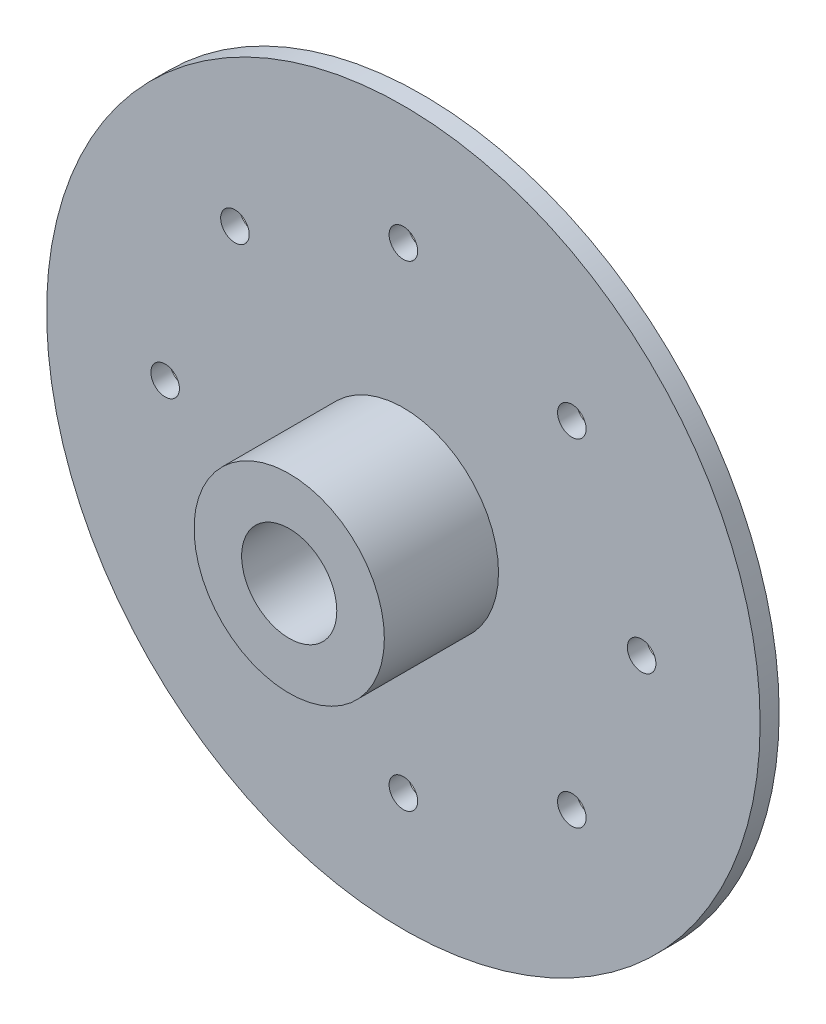
ISO-10303-21;
HEADER;
FILE_DESCRIPTION(('STEP AP214'),'2;1');
FILE_NAME('part.step','',(''),(''),'','','');
FILE_SCHEMA(('AUTOMOTIVE_DESIGN { 1 0 10303 214 1 1 1 1 }'));
ENDSEC;
DATA;
#1=APPLICATION_CONTEXT('core data for automotive mechanical design processes');
#2=APPLICATION_PROTOCOL_DEFINITION('international standard','automotive_design',2000,#1);
#3=PRODUCT_CONTEXT('',#1,'mechanical');
#4=PRODUCT('Part','Part','',(#3));
#5=PRODUCT_RELATED_PRODUCT_CATEGORY('part','',(#4));
#6=PRODUCT_DEFINITION_FORMATION('','',#4);
#7=PRODUCT_DEFINITION_CONTEXT('part definition',#1,'design');
#8=PRODUCT_DEFINITION('design','',#6,#7);
#9=PRODUCT_DEFINITION_SHAPE('','',#8);
#10=(LENGTH_UNIT() NAMED_UNIT(*) SI_UNIT(.MILLI.,.METRE.));
#11=(NAMED_UNIT(*) PLANE_ANGLE_UNIT() SI_UNIT($,.RADIAN.));
#12=(NAMED_UNIT(*) SI_UNIT($,.STERADIAN.) SOLID_ANGLE_UNIT());
#13=UNCERTAINTY_MEASURE_WITH_UNIT(LENGTH_MEASURE(1.E-05),#10,'distance_accuracy_value','');
#14=(GEOMETRIC_REPRESENTATION_CONTEXT(3) GLOBAL_UNCERTAINTY_ASSIGNED_CONTEXT((#13)) GLOBAL_UNIT_ASSIGNED_CONTEXT((#10,
#11,#12)) REPRESENTATION_CONTEXT('',''));
#15=CARTESIAN_POINT('',(0.,0.,0.));
#16=DIRECTION('',(0.,0.,1.));
#17=DIRECTION('',(1.,0.,0.));
#18=AXIS2_PLACEMENT_3D('',#15,#16,#17);
#19=CARTESIAN_POINT('',(0.,0.,2.));
#20=DIRECTION('',(0.,0.,-1.));
#21=DIRECTION('',(-1.,0.,0.));
#22=AXIS2_PLACEMENT_3D('',#19,#20,#21);
#23=CYLINDRICAL_SURFACE('',#22,37.5);
#24=CARTESIAN_POINT('',(0.,0.,2.));
#25=DIRECTION('',(0.,0.,1.));
#26=DIRECTION('',(1.,0.,0.));
#27=AXIS2_PLACEMENT_3D('',#24,#25,#26);
#28=CIRCLE('',#27,37.5);
#29=CARTESIAN_POINT('',(37.5,0.,2.));
#30=VERTEX_POINT('',#29);
#31=EDGE_CURVE('E36',#30,#30,#28,.T.);
#32=ORIENTED_EDGE('',*,*,#31,.F.);
#33=EDGE_LOOP('',(#32));
#34=FACE_BOUND('',#33,.T.);
#35=CARTESIAN_POINT('',(0.,0.,0.));
#36=DIRECTION('',(0.,0.,1.));
#37=DIRECTION('',(1.,0.,0.));
#38=AXIS2_PLACEMENT_3D('',#35,#36,#37);
#39=CIRCLE('',#38,37.5);
#40=CARTESIAN_POINT('',(37.5,0.,0.));
#41=VERTEX_POINT('',#40);
#42=EDGE_CURVE('E40',#41,#41,#39,.T.);
#43=ORIENTED_EDGE('',*,*,#42,.T.);
#44=EDGE_LOOP('',(#43));
#45=FACE_BOUND('',#44,.T.);
#46=ADVANCED_FACE('F30',(#34,#45),#23,.T.);
#47=CARTESIAN_POINT('',(0.,0.,2.));
#48=DIRECTION('',(0.,0.,1.));
#49=DIRECTION('',(1.,0.,0.));
#50=AXIS2_PLACEMENT_3D('',#47,#48,#49);
#51=PLANE('',#50);
#52=CARTESIAN_POINT('',(0.,0.,2.));
#53=DIRECTION('',(0.,0.,1.));
#54=DIRECTION('',(1.,0.,0.));
#55=AXIS2_PLACEMENT_3D('',#52,#53,#54);
#56=CIRCLE('',#55,10.);
#57=CARTESIAN_POINT('',(10.,0.,2.));
#58=VERTEX_POINT('',#57);
#59=EDGE_CURVE('E258',#58,#58,#56,.T.);
#60=ORIENTED_EDGE('',*,*,#59,.F.);
#61=EDGE_LOOP('',(#60));
#62=FACE_BOUND('',#61,.T.);
#63=CARTESIAN_POINT('',(-25.0400641025641,-0.040064102564196,2.));
#64=DIRECTION('',(0.,0.,1.));
#65=DIRECTION('',(0.,1.,0.));
#66=AXIS2_PLACEMENT_3D('',#63,#64,#65);
#67=CIRCLE('',#66,1.5);
#68=CARTESIAN_POINT('',(-25.0400641025641,1.4599358974358,2.));
#69=VERTEX_POINT('',#68);
#70=EDGE_CURVE('E238',#69,#69,#67,.T.);
#71=ORIENTED_EDGE('',*,*,#70,.F.);
#72=EDGE_LOOP('',(#71));
#73=FACE_BOUND('',#72,.T.);
#74=CARTESIAN_POINT('',(-17.7059991282688,-17.7460632308331,2.));
#75=DIRECTION('',(0.,0.,1.));
#76=DIRECTION('',(-0.707106781186551,0.707106781186544,0.));
#77=AXIS2_PLACEMENT_3D('',#74,#75,#76);
#78=CIRCLE('',#77,1.5);
#79=CARTESIAN_POINT('',(-18.7666593000486,-16.6854030590533,2.));
#80=VERTEX_POINT('',#79);
#81=EDGE_CURVE('E240',#80,#80,#78,.T.);
#82=ORIENTED_EDGE('',*,*,#81,.F.);
#83=EDGE_LOOP('',(#82));
#84=FACE_BOUND('',#83,.T.);
#85=CARTESIAN_POINT('',(0.,-25.0801282051282,2.));
#86=DIRECTION('',(0.,0.,1.));
#87=DIRECTION('',(-1.,0.,0.));
#88=AXIS2_PLACEMENT_3D('',#85,#86,#87);
#89=CIRCLE('',#88,1.5);
#90=CARTESIAN_POINT('',(-1.49999999999999,-25.0801282051282,2.));
#91=VERTEX_POINT('',#90);
#92=EDGE_CURVE('E246',#91,#91,#89,.T.);
#93=ORIENTED_EDGE('',*,*,#92,.F.);
#94=EDGE_LOOP('',(#93));
#95=FACE_BOUND('',#94,.T.);
#96=CARTESIAN_POINT('',(17.7059991282691,-17.7460632308329,2.));
#97=DIRECTION('',(0.,0.,1.));
#98=DIRECTION('',(-0.707106781186541,-0.707106781186554,0.));
#99=AXIS2_PLACEMENT_3D('',#96,#97,#98);
#100=CIRCLE('',#99,1.5);
#101=CARTESIAN_POINT('',(16.6453389564893,-18.8067234026127,2.));
#102=VERTEX_POINT('',#101);
#103=EDGE_CURVE('E243',#102,#102,#100,.T.);
#104=ORIENTED_EDGE('',*,*,#103,.F.);
#105=EDGE_LOOP('',(#104));
#106=FACE_BOUND('',#105,.T.);
#107=CARTESIAN_POINT('',(25.0400641025641,-0.0400641025638342,2.));
#108=DIRECTION('',(0.,0.,1.));
#109=DIRECTION('',(0.,-1.,0.));
#110=AXIS2_PLACEMENT_3D('',#107,#108,#109);
#111=CIRCLE('',#110,1.5);
#112=CARTESIAN_POINT('',(25.0400641025641,-1.54006410256384,2.));
#113=VERTEX_POINT('',#112);
#114=EDGE_CURVE('E247',#113,#113,#111,.T.);
#115=ORIENTED_EDGE('',*,*,#114,.F.);
#116=EDGE_LOOP('',(#115));
#117=FACE_BOUND('',#116,.T.);
#118=CARTESIAN_POINT('',(17.7059991282687,17.665935025705,2.));
#119=DIRECTION('',(0.,0.,1.));
#120=DIRECTION('',(0.707106781186556,-0.707106781186539,0.));
#121=AXIS2_PLACEMENT_3D('',#118,#119,#120);
#122=CIRCLE('',#121,1.5);
#123=CARTESIAN_POINT('',(18.7666593000485,16.6052748539252,2.));
#124=VERTEX_POINT('',#123);
#125=EDGE_CURVE('E252',#124,#124,#122,.T.);
#126=ORIENTED_EDGE('',*,*,#125,.F.);
#127=EDGE_LOOP('',(#126));
#128=FACE_BOUND('',#127,.T.);
#129=CARTESIAN_POINT('',(-17.7059991282689,17.6659350257048,2.));
#130=DIRECTION('',(0.,0.,1.));
#131=DIRECTION('',(0.707106781186546,0.707106781186549,0.));
#132=AXIS2_PLACEMENT_3D('',#129,#130,#131);
#133=CIRCLE('',#132,1.5);
#134=CARTESIAN_POINT('',(-16.6453389564891,18.7265951974846,2.));
#135=VERTEX_POINT('',#134);
#136=EDGE_CURVE('E57',#135,#135,#133,.T.);
#137=ORIENTED_EDGE('',*,*,#136,.F.);
#138=EDGE_LOOP('',(#137));
#139=FACE_BOUND('',#138,.T.);
#140=CARTESIAN_POINT('',(0.,25.,2.));
#141=DIRECTION('',(0.,0.,1.));
#142=DIRECTION('',(1.,0.,0.));
#143=AXIS2_PLACEMENT_3D('',#140,#141,#142);
#144=CIRCLE('',#143,1.5);
#145=CARTESIAN_POINT('',(1.5,25.,2.));
#146=VERTEX_POINT('',#145);
#147=EDGE_CURVE('E48',#146,#146,#144,.T.);
#148=ORIENTED_EDGE('',*,*,#147,.F.);
#149=EDGE_LOOP('',(#148));
#150=FACE_BOUND('',#149,.T.);
#151=ORIENTED_EDGE('',*,*,#31,.T.);
#152=EDGE_LOOP('',(#151));
#153=FACE_BOUND('',#152,.T.);
#154=ADVANCED_FACE('F81',(#62,#73,#84,#95,#106,#117,#128,#139,#150,#153),#51,.T.);
#155=CARTESIAN_POINT('',(0.,0.,0.));
#156=DIRECTION('',(0.,0.,1.));
#157=DIRECTION('',(1.,0.,0.));
#158=AXIS2_PLACEMENT_3D('',#155,#156,#157);
#159=PLANE('',#158);
#160=CARTESIAN_POINT('',(-25.0400641025641,-0.040064102564196,0.));
#161=DIRECTION('',(0.,0.,1.));
#162=DIRECTION('',(1.,0.,0.));
#163=AXIS2_PLACEMENT_3D('',#160,#161,#162);
#164=CIRCLE('',#163,1.5);
#165=CARTESIAN_POINT('',(-23.5400641025641,-0.040064102564196,0.));
#166=VERTEX_POINT('',#165);
#167=EDGE_CURVE('E71',#166,#166,#164,.T.);
#168=ORIENTED_EDGE('',*,*,#167,.T.);
#169=EDGE_LOOP('',(#168));
#170=FACE_BOUND('',#169,.T.);
#171=CARTESIAN_POINT('',(-17.7059991282688,-17.7460632308331,0.));
#172=DIRECTION('',(0.,0.,1.));
#173=DIRECTION('',(1.,0.,0.));
#174=AXIS2_PLACEMENT_3D('',#171,#172,#173);
#175=CIRCLE('',#174,1.5);
#176=CARTESIAN_POINT('',(-16.2059991282688,-17.7460632308331,0.));
#177=VERTEX_POINT('',#176);
#178=EDGE_CURVE('E69',#177,#177,#175,.T.);
#179=ORIENTED_EDGE('',*,*,#178,.T.);
#180=EDGE_LOOP('',(#179));
#181=FACE_BOUND('',#180,.T.);
#182=CARTESIAN_POINT('',(0.,-25.0801282051282,0.));
#183=DIRECTION('',(0.,0.,1.));
#184=DIRECTION('',(1.,0.,0.));
#185=AXIS2_PLACEMENT_3D('',#182,#183,#184);
#186=CIRCLE('',#185,1.5);
#187=CARTESIAN_POINT('',(1.50000000000001,-25.0801282051282,0.));
#188=VERTEX_POINT('',#187);
#189=EDGE_CURVE('E66',#188,#188,#186,.T.);
#190=ORIENTED_EDGE('',*,*,#189,.T.);
#191=EDGE_LOOP('',(#190));
#192=FACE_BOUND('',#191,.T.);
#193=CARTESIAN_POINT('',(17.7059991282691,-17.7460632308329,0.));
#194=DIRECTION('',(0.,0.,1.));
#195=DIRECTION('',(1.,0.,0.));
#196=AXIS2_PLACEMENT_3D('',#193,#194,#195);
#197=CIRCLE('',#196,1.5);
#198=CARTESIAN_POINT('',(19.2059991282691,-17.7460632308329,0.));
#199=VERTEX_POINT('',#198);
#200=EDGE_CURVE('E63',#199,#199,#197,.T.);
#201=ORIENTED_EDGE('',*,*,#200,.T.);
#202=EDGE_LOOP('',(#201));
#203=FACE_BOUND('',#202,.T.);
#204=CARTESIAN_POINT('',(25.0400641025641,-0.0400641025638342,0.));
#205=DIRECTION('',(0.,0.,1.));
#206=DIRECTION('',(1.,0.,0.));
#207=AXIS2_PLACEMENT_3D('',#204,#205,#206);
#208=CIRCLE('',#207,1.5);
#209=CARTESIAN_POINT('',(26.5400641025641,-0.0400641025638342,0.));
#210=VERTEX_POINT('',#209);
#211=EDGE_CURVE('E60',#210,#210,#208,.T.);
#212=ORIENTED_EDGE('',*,*,#211,.T.);
#213=EDGE_LOOP('',(#212));
#214=FACE_BOUND('',#213,.T.);
#215=CARTESIAN_POINT('',(17.7059991282687,17.665935025705,0.));
#216=DIRECTION('',(0.,0.,1.));
#217=DIRECTION('',(1.,0.,0.));
#218=AXIS2_PLACEMENT_3D('',#215,#216,#217);
#219=CIRCLE('',#218,1.5);
#220=CARTESIAN_POINT('',(19.2059991282687,17.665935025705,0.));
#221=VERTEX_POINT('',#220);
#222=EDGE_CURVE('E56',#221,#221,#219,.T.);
#223=ORIENTED_EDGE('',*,*,#222,.T.);
#224=EDGE_LOOP('',(#223));
#225=FACE_BOUND('',#224,.T.);
#226=CARTESIAN_POINT('',(-17.7059991282689,17.6659350257048,0.));
#227=DIRECTION('',(0.,0.,1.));
#228=DIRECTION('',(1.,0.,0.));
#229=AXIS2_PLACEMENT_3D('',#226,#227,#228);
#230=CIRCLE('',#229,1.5);
#231=CARTESIAN_POINT('',(-16.2059991282689,17.6659350257048,0.));
#232=VERTEX_POINT('',#231);
#233=EDGE_CURVE('E53',#232,#232,#230,.T.);
#234=ORIENTED_EDGE('',*,*,#233,.T.);
#235=EDGE_LOOP('',(#234));
#236=FACE_BOUND('',#235,.T.);
#237=CARTESIAN_POINT('',(0.,25.,0.));
#238=DIRECTION('',(0.,0.,1.));
#239=DIRECTION('',(1.,0.,0.));
#240=AXIS2_PLACEMENT_3D('',#237,#238,#239);
#241=CIRCLE('',#240,1.5);
#242=CARTESIAN_POINT('',(1.5,25.,0.));
#243=VERTEX_POINT('',#242);
#244=EDGE_CURVE('E45',#243,#243,#241,.T.);
#245=ORIENTED_EDGE('',*,*,#244,.T.);
#246=EDGE_LOOP('',(#245));
#247=FACE_BOUND('',#246,.T.);
#248=ORIENTED_EDGE('',*,*,#42,.F.);
#249=EDGE_LOOP('',(#248));
#250=FACE_BOUND('',#249,.T.);
#251=ADVANCED_FACE('F83',(#170,#181,#192,#203,#214,#225,#236,#247,#250),#159,.F.);
#252=CARTESIAN_POINT('',(0.,25.,-8.));
#253=DIRECTION('',(0.,0.,1.));
#254=DIRECTION('',(1.,0.,0.));
#255=AXIS2_PLACEMENT_3D('',#252,#253,#254);
#256=CYLINDRICAL_SURFACE('',#255,1.5);
#257=ORIENTED_EDGE('',*,*,#147,.T.);
#258=EDGE_LOOP('',(#257));
#259=FACE_BOUND('',#258,.T.);
#260=ORIENTED_EDGE('',*,*,#244,.F.);
#261=EDGE_LOOP('',(#260));
#262=FACE_BOUND('',#261,.T.);
#263=ADVANCED_FACE('F78',(#259,#262),#256,.F.);
#264=CARTESIAN_POINT('',(-17.7059991282689,17.6659350257048,-8.));
#265=DIRECTION('',(0.,0.,1.));
#266=DIRECTION('',(1.,0.,0.));
#267=AXIS2_PLACEMENT_3D('',#264,#265,#266);
#268=CYLINDRICAL_SURFACE('',#267,1.5);
#269=ORIENTED_EDGE('',*,*,#136,.T.);
#270=EDGE_LOOP('',(#269));
#271=FACE_BOUND('',#270,.T.);
#272=ORIENTED_EDGE('',*,*,#233,.F.);
#273=EDGE_LOOP('',(#272));
#274=FACE_BOUND('',#273,.T.);
#275=ADVANCED_FACE('F124',(#271,#274),#268,.F.);
#276=CARTESIAN_POINT('',(17.7059991282687,17.665935025705,-8.));
#277=DIRECTION('',(0.,0.,1.));
#278=DIRECTION('',(1.,0.,0.));
#279=AXIS2_PLACEMENT_3D('',#276,#277,#278);
#280=CYLINDRICAL_SURFACE('',#279,1.5);
#281=ORIENTED_EDGE('',*,*,#125,.T.);
#282=EDGE_LOOP('',(#281));
#283=FACE_BOUND('',#282,.T.);
#284=ORIENTED_EDGE('',*,*,#222,.F.);
#285=EDGE_LOOP('',(#284));
#286=FACE_BOUND('',#285,.T.);
#287=ADVANCED_FACE('F120',(#283,#286),#280,.F.);
#288=CARTESIAN_POINT('',(25.0400641025641,-0.0400641025638342,-8.));
#289=DIRECTION('',(0.,0.,1.));
#290=DIRECTION('',(1.,0.,0.));
#291=AXIS2_PLACEMENT_3D('',#288,#289,#290);
#292=CYLINDRICAL_SURFACE('',#291,1.5);
#293=ORIENTED_EDGE('',*,*,#114,.T.);
#294=EDGE_LOOP('',(#293));
#295=FACE_BOUND('',#294,.T.);
#296=ORIENTED_EDGE('',*,*,#211,.F.);
#297=EDGE_LOOP('',(#296));
#298=FACE_BOUND('',#297,.T.);
#299=ADVANCED_FACE('F116',(#295,#298),#292,.F.);
#300=CARTESIAN_POINT('',(17.7059991282691,-17.7460632308329,-8.));
#301=DIRECTION('',(0.,0.,1.));
#302=DIRECTION('',(1.,0.,0.));
#303=AXIS2_PLACEMENT_3D('',#300,#301,#302);
#304=CYLINDRICAL_SURFACE('',#303,1.5);
#305=ORIENTED_EDGE('',*,*,#103,.T.);
#306=EDGE_LOOP('',(#305));
#307=FACE_BOUND('',#306,.T.);
#308=ORIENTED_EDGE('',*,*,#200,.F.);
#309=EDGE_LOOP('',(#308));
#310=FACE_BOUND('',#309,.T.);
#311=ADVANCED_FACE('F119',(#307,#310),#304,.F.);
#312=CARTESIAN_POINT('',(0.,-25.0801282051282,-8.));
#313=DIRECTION('',(0.,0.,1.));
#314=DIRECTION('',(1.,0.,0.));
#315=AXIS2_PLACEMENT_3D('',#312,#313,#314);
#316=CYLINDRICAL_SURFACE('',#315,1.5);
#317=ORIENTED_EDGE('',*,*,#92,.T.);
#318=EDGE_LOOP('',(#317));
#319=FACE_BOUND('',#318,.T.);
#320=ORIENTED_EDGE('',*,*,#189,.F.);
#321=EDGE_LOOP('',(#320));
#322=FACE_BOUND('',#321,.T.);
#323=ADVANCED_FACE('F132',(#319,#322),#316,.F.);
#324=CARTESIAN_POINT('',(-17.7059991282688,-17.7460632308331,-8.));
#325=DIRECTION('',(0.,0.,1.));
#326=DIRECTION('',(1.,0.,0.));
#327=AXIS2_PLACEMENT_3D('',#324,#325,#326);
#328=CYLINDRICAL_SURFACE('',#327,1.5);
#329=ORIENTED_EDGE('',*,*,#81,.T.);
#330=EDGE_LOOP('',(#329));
#331=FACE_BOUND('',#330,.T.);
#332=ORIENTED_EDGE('',*,*,#178,.F.);
#333=EDGE_LOOP('',(#332));
#334=FACE_BOUND('',#333,.T.);
#335=ADVANCED_FACE('F128',(#331,#334),#328,.F.);
#336=CARTESIAN_POINT('',(-25.0400641025641,-0.040064102564196,-8.));
#337=DIRECTION('',(0.,0.,1.));
#338=DIRECTION('',(1.,0.,0.));
#339=AXIS2_PLACEMENT_3D('',#336,#337,#338);
#340=CYLINDRICAL_SURFACE('',#339,1.5);
#341=ORIENTED_EDGE('',*,*,#70,.T.);
#342=EDGE_LOOP('',(#341));
#343=FACE_BOUND('',#342,.T.);
#344=ORIENTED_EDGE('',*,*,#167,.F.);
#345=EDGE_LOOP('',(#344));
#346=FACE_BOUND('',#345,.T.);
#347=ADVANCED_FACE('F113',(#343,#346),#340,.F.);
#348=CARTESIAN_POINT('',(0.,0.,14.));
#349=DIRECTION('',(0.,0.,1.));
#350=DIRECTION('',(1.,0.,0.));
#351=AXIS2_PLACEMENT_3D('',#348,#349,#350);
#352=PLANE('',#351);
#353=CARTESIAN_POINT('',(0.,0.,14.));
#354=DIRECTION('',(0.,0.,1.));
#355=DIRECTION('',(1.,0.,0.));
#356=AXIS2_PLACEMENT_3D('',#353,#354,#355);
#357=CIRCLE('',#356,10.);
#358=CARTESIAN_POINT('',(10.,0.,14.));
#359=VERTEX_POINT('',#358);
#360=EDGE_CURVE('E255',#359,#359,#357,.T.);
#361=ORIENTED_EDGE('',*,*,#360,.T.);
#362=EDGE_LOOP('',(#361));
#363=FACE_BOUND('',#362,.T.);
#364=CARTESIAN_POINT('',(0.,0.,14.));
#365=DIRECTION('',(0.,0.,1.));
#366=DIRECTION('',(1.,0.,0.));
#367=AXIS2_PLACEMENT_3D('',#364,#365,#366);
#368=CIRCLE('',#367,5.);
#369=CARTESIAN_POINT('',(5.,0.,14.));
#370=VERTEX_POINT('',#369);
#371=EDGE_CURVE('E261',#370,#370,#368,.T.);
#372=ORIENTED_EDGE('',*,*,#371,.F.);
#373=EDGE_LOOP('',(#372));
#374=FACE_BOUND('',#373,.T.);
#375=ADVANCED_FACE('F107',(#363,#374),#352,.T.);
#376=CARTESIAN_POINT('',(0.,0.,14.));
#377=DIRECTION('',(0.,0.,-1.));
#378=DIRECTION('',(-1.,0.,0.));
#379=AXIS2_PLACEMENT_3D('',#376,#377,#378);
#380=CYLINDRICAL_SURFACE('',#379,10.);
#381=ORIENTED_EDGE('',*,*,#360,.F.);
#382=EDGE_LOOP('',(#381));
#383=FACE_BOUND('',#382,.T.);
#384=ORIENTED_EDGE('',*,*,#59,.T.);
#385=EDGE_LOOP('',(#384));
#386=FACE_BOUND('',#385,.T.);
#387=ADVANCED_FACE('F101',(#383,#386),#380,.T.);
#388=CARTESIAN_POINT('',(0.,0.,14.));
#389=DIRECTION('',(0.,0.,-1.));
#390=DIRECTION('',(-1.,0.,0.));
#391=AXIS2_PLACEMENT_3D('',#388,#389,#390);
#392=CYLINDRICAL_SURFACE('',#391,5.);
#393=ORIENTED_EDGE('',*,*,#371,.T.);
#394=EDGE_LOOP('',(#393));
#395=FACE_BOUND('',#394,.T.);
#396=CARTESIAN_POINT('',(0.,0.,2.));
#397=DIRECTION('',(0.,0.,1.));
#398=DIRECTION('',(1.,0.,0.));
#399=AXIS2_PLACEMENT_3D('',#396,#397,#398);
#400=CIRCLE('',#399,5.);
#401=CARTESIAN_POINT('',(5.,0.,2.));
#402=VERTEX_POINT('',#401);
#403=EDGE_CURVE('E10',#402,#402,#400,.F.);
#404=ORIENTED_EDGE('',*,*,#403,.T.);
#405=EDGE_LOOP('',(#404));
#406=FACE_BOUND('',#405,.T.);
#407=ADVANCED_FACE('F96',(#395,#406),#392,.F.);
#408=ORIENTED_EDGE('',*,*,#403,.F.);
#409=EDGE_LOOP('',(#408));
#410=FACE_BOUND('',#409,.T.);
#411=ADVANCED_FACE('F86',(#410),#51,.T.);
#412=CLOSED_SHELL('',(#46,#154,#251,#263,#275,#287,#299,#311,#323,#335,#347,#375,#387,#407,#411));
#413=MANIFOLD_SOLID_BREP('B2',#412);
#414=ADVANCED_BREP_SHAPE_REPRESENTATION('',(#18,#413),#14);
#415=SHAPE_DEFINITION_REPRESENTATION(#9,#414);
ENDSEC;
END-ISO-10303-21;
